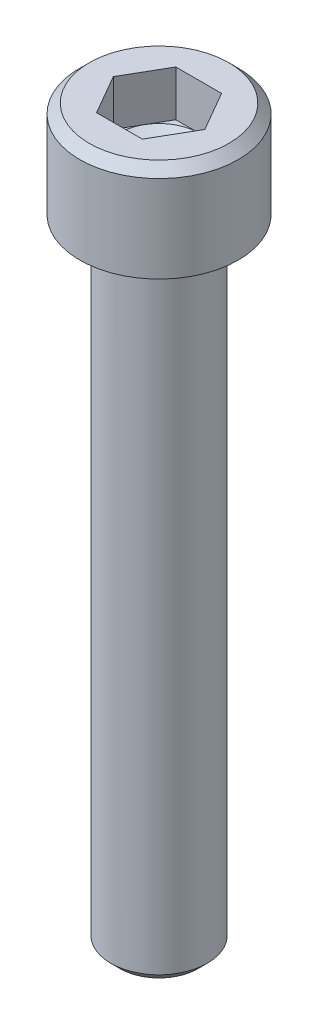
ISO-10303-21;
HEADER;
FILE_DESCRIPTION(('STEP AP214'),'2;1');
FILE_NAME('part.step','',(''),(''),'','','');
FILE_SCHEMA(('AUTOMOTIVE_DESIGN { 1 0 10303 214 1 1 1 1 }'));
ENDSEC;
DATA;
#1=APPLICATION_CONTEXT('core data for automotive mechanical design processes');
#2=APPLICATION_PROTOCOL_DEFINITION('international standard','automotive_design',2000,#1);
#3=PRODUCT_CONTEXT('',#1,'mechanical');
#4=PRODUCT('Part','Part','',(#3));
#5=PRODUCT_RELATED_PRODUCT_CATEGORY('part','',(#4));
#6=PRODUCT_DEFINITION_FORMATION('','',#4);
#7=PRODUCT_DEFINITION_CONTEXT('part definition',#1,'design');
#8=PRODUCT_DEFINITION('design','',#6,#7);
#9=PRODUCT_DEFINITION_SHAPE('','',#8);
#10=(LENGTH_UNIT() NAMED_UNIT(*) SI_UNIT(.MILLI.,.METRE.));
#11=(NAMED_UNIT(*) PLANE_ANGLE_UNIT() SI_UNIT($,.RADIAN.));
#12=(NAMED_UNIT(*) SI_UNIT($,.STERADIAN.) SOLID_ANGLE_UNIT());
#13=UNCERTAINTY_MEASURE_WITH_UNIT(LENGTH_MEASURE(1.E-05),#10,'distance_accuracy_value','');
#14=(GEOMETRIC_REPRESENTATION_CONTEXT(3) GLOBAL_UNCERTAINTY_ASSIGNED_CONTEXT((#13)) GLOBAL_UNIT_ASSIGNED_CONTEXT((#10,
#11,#12)) REPRESENTATION_CONTEXT('',''));
#15=CARTESIAN_POINT('',(0.,0.,0.));
#16=DIRECTION('',(0.,0.,1.));
#17=DIRECTION('',(1.,0.,0.));
#18=AXIS2_PLACEMENT_3D('',#15,#16,#17);
#19=CARTESIAN_POINT('',(0.,2.54,0.));
#20=DIRECTION('',(0.,1.,0.));
#21=DIRECTION('',(-1.,0.,0.));
#22=AXIS2_PLACEMENT_3D('',#19,#20,#21);
#23=PLANE('',#22);
#24=DIRECTION('',(-1.,0.,0.));
#25=VECTOR('',#24,1.);
#26=CARTESIAN_POINT('',(0.,2.54,1.985));
#27=LINE('',#26,#25);
#28=CARTESIAN_POINT('',(-1.14604028434141,2.54,1.985));
#29=VERTEX_POINT('',#28);
#30=CARTESIAN_POINT('',(0.,2.53999999997418,1.98499999995501));
#31=VERTEX_POINT('',#30);
#32=EDGE_CURVE('E96',#29,#31,#27,.F.);
#33=ORIENTED_EDGE('',*,*,#32,.T.);
#34=CARTESIAN_POINT('',(0.,2.53999999999519,0.));
#35=DIRECTION('',(0.,1.,0.));
#36=DIRECTION('',(0.,0.,1.));
#37=AXIS2_PLACEMENT_3D('',#34,#35,#36);
#38=CIRCLE('',#37,1.98499999999058);
#39=CARTESIAN_POINT('',(-1.71906042650803,2.5399999999976,0.992499999997643));
#40=VERTEX_POINT('',#39);
#41=EDGE_CURVE('E109',#31,#40,#38,.F.);
#42=ORIENTED_EDGE('',*,*,#41,.T.);
#43=DIRECTION('',(0.5,0.,0.866025403784439));
#44=VECTOR('',#43,1.);
#45=CARTESIAN_POINT('',(-1.71906042651211,2.54,0.992499999999999));
#46=LINE('',#45,#44);
#47=EDGE_CURVE('E112',#40,#29,#46,.T.);
#48=ORIENTED_EDGE('',*,*,#47,.T.);
#49=EDGE_LOOP('',(#33,#42,#48));
#50=FACE_BOUND('',#49,.T.);
#51=ADVANCED_FACE('F15',(#50),#23,.T.);
#52=CARTESIAN_POINT('',(0.,2.54,0.));
#53=DIRECTION('',(0.,1.,0.));
#54=DIRECTION('',(-1.,0.,0.));
#55=AXIS2_PLACEMENT_3D('',#52,#53,#54);
#56=PLANE('',#55);
#57=DIRECTION('',(0.499999999999998,0.,0.866025403784439));
#58=VECTOR('',#57,1.);
#59=CARTESIAN_POINT('',(-2.29208056868281,2.54,0.));
#60=LINE('',#59,#58);
#61=CARTESIAN_POINT('',(-2.29208056868281,2.54,0.));
#62=VERTEX_POINT('',#61);
#63=EDGE_CURVE('E186',#62,#40,#60,.T.);
#64=ORIENTED_EDGE('',*,*,#63,.T.);
#65=CARTESIAN_POINT('',(0.,2.53999999999519,0.));
#66=DIRECTION('',(0.,1.,0.));
#67=DIRECTION('',(0.,0.,1.));
#68=AXIS2_PLACEMENT_3D('',#65,#66,#67);
#69=CIRCLE('',#68,1.98499999999058);
#70=CARTESIAN_POINT('',(-1.71906042650803,2.5399999999976,-0.992499999997645));
#71=VERTEX_POINT('',#70);
#72=EDGE_CURVE('E128',#40,#71,#69,.F.);
#73=ORIENTED_EDGE('',*,*,#72,.T.);
#74=DIRECTION('',(-0.499999999999999,0.,0.866025403784439));
#75=VECTOR('',#74,1.);
#76=CARTESIAN_POINT('',(-1.71906042651211,2.54,-0.992500000000001));
#77=LINE('',#76,#75);
#78=EDGE_CURVE('E113',#71,#62,#77,.T.);
#79=ORIENTED_EDGE('',*,*,#78,.T.);
#80=EDGE_LOOP('',(#64,#73,#79));
#81=FACE_BOUND('',#80,.T.);
#82=ADVANCED_FACE('F337',(#81),#56,.T.);
#83=CARTESIAN_POINT('',(0.,2.54,0.));
#84=DIRECTION('',(0.,1.,0.));
#85=DIRECTION('',(-1.,0.,0.));
#86=AXIS2_PLACEMENT_3D('',#83,#84,#85);
#87=PLANE('',#86);
#88=DIRECTION('',(-0.5,0.,0.866025403784438));
#89=VECTOR('',#88,1.);
#90=CARTESIAN_POINT('',(-1.14604028434141,2.54,-1.985));
#91=LINE('',#90,#89);
#92=CARTESIAN_POINT('',(-1.14604028434141,2.54,-1.985));
#93=VERTEX_POINT('',#92);
#94=EDGE_CURVE('E195',#93,#71,#91,.T.);
#95=ORIENTED_EDGE('',*,*,#94,.T.);
#96=CARTESIAN_POINT('',(0.,2.53999999999519,0.));
#97=DIRECTION('',(0.,1.,0.));
#98=DIRECTION('',(0.,0.,1.));
#99=AXIS2_PLACEMENT_3D('',#96,#97,#98);
#100=CIRCLE('',#99,1.98499999999058);
#101=CARTESIAN_POINT('',(0.,2.53999999996917,-1.98499999993845));
#102=VERTEX_POINT('',#101);
#103=EDGE_CURVE('E130',#71,#102,#100,.F.);
#104=ORIENTED_EDGE('',*,*,#103,.T.);
#105=DIRECTION('',(-1.,0.,0.));
#106=VECTOR('',#105,1.);
#107=CARTESIAN_POINT('',(0.,2.54,-1.985));
#108=LINE('',#107,#106);
#109=EDGE_CURVE('E190',#102,#93,#108,.T.);
#110=ORIENTED_EDGE('',*,*,#109,.T.);
#111=EDGE_LOOP('',(#95,#104,#110));
#112=FACE_BOUND('',#111,.T.);
#113=ADVANCED_FACE('F334',(#112),#87,.T.);
#114=CARTESIAN_POINT('',(0.,2.54,0.));
#115=DIRECTION('',(0.,1.,0.));
#116=DIRECTION('',(-1.,0.,0.));
#117=AXIS2_PLACEMENT_3D('',#114,#115,#116);
#118=PLANE('',#117);
#119=DIRECTION('',(-1.,0.,0.));
#120=VECTOR('',#119,1.);
#121=CARTESIAN_POINT('',(0.,2.54,-1.985));
#122=LINE('',#121,#120);
#123=CARTESIAN_POINT('',(1.14604028434141,2.54,-1.985));
#124=VERTEX_POINT('',#123);
#125=EDGE_CURVE('E103',#124,#102,#122,.T.);
#126=ORIENTED_EDGE('',*,*,#125,.T.);
#127=CARTESIAN_POINT('',(0.,2.53999999999519,0.));
#128=DIRECTION('',(0.,1.,0.));
#129=DIRECTION('',(0.,0.,1.));
#130=AXIS2_PLACEMENT_3D('',#127,#128,#129);
#131=CIRCLE('',#130,1.98499999999058);
#132=CARTESIAN_POINT('',(1.71906042650803,2.53999999999759,-0.992499999997645));
#133=VERTEX_POINT('',#132);
#134=EDGE_CURVE('E122',#102,#133,#131,.F.);
#135=ORIENTED_EDGE('',*,*,#134,.T.);
#136=DIRECTION('',(-0.5,0.,-0.866025403784438));
#137=VECTOR('',#136,1.);
#138=CARTESIAN_POINT('',(1.71906042651211,2.54,-0.9925));
#139=LINE('',#138,#137);
#140=EDGE_CURVE('E200',#133,#124,#139,.T.);
#141=ORIENTED_EDGE('',*,*,#140,.T.);
#142=EDGE_LOOP('',(#126,#135,#141));
#143=FACE_BOUND('',#142,.T.);
#144=ADVANCED_FACE('F331',(#143),#118,.T.);
#145=CARTESIAN_POINT('',(0.,2.54,0.));
#146=DIRECTION('',(0.,1.,0.));
#147=DIRECTION('',(-1.,0.,0.));
#148=AXIS2_PLACEMENT_3D('',#145,#146,#147);
#149=PLANE('',#148);
#150=DIRECTION('',(0.5,0.,-0.866025403784439));
#151=VECTOR('',#150,1.);
#152=CARTESIAN_POINT('',(1.14604028434141,2.54,1.985));
#153=LINE('',#152,#151);
#154=CARTESIAN_POINT('',(1.14604028434141,2.54,1.985));
#155=VERTEX_POINT('',#154);
#156=CARTESIAN_POINT('',(1.71906042650803,2.5399999999976,0.992499999997644));
#157=VERTEX_POINT('',#156);
#158=EDGE_CURVE('E102',#155,#157,#153,.T.);
#159=ORIENTED_EDGE('',*,*,#158,.T.);
#160=CARTESIAN_POINT('',(0.,2.53999999999519,0.));
#161=DIRECTION('',(0.,1.,0.));
#162=DIRECTION('',(0.,0.,1.));
#163=AXIS2_PLACEMENT_3D('',#160,#161,#162);
#164=CIRCLE('',#163,1.98499999999058);
#165=EDGE_CURVE('E116',#157,#31,#164,.F.);
#166=ORIENTED_EDGE('',*,*,#165,.T.);
#167=DIRECTION('',(-1.,0.,0.));
#168=VECTOR('',#167,1.);
#169=CARTESIAN_POINT('',(0.,2.54,1.985));
#170=LINE('',#169,#168);
#171=EDGE_CURVE('E93',#31,#155,#170,.F.);
#172=ORIENTED_EDGE('',*,*,#171,.T.);
#173=EDGE_LOOP('',(#159,#166,#172));
#174=FACE_BOUND('',#173,.T.);
#175=ADVANCED_FACE('F117',(#174),#149,.T.);
#176=CARTESIAN_POINT('',(0.,2.53999999989674,0.));
#177=DIRECTION('',(0.,1.,0.));
#178=DIRECTION('',(0.,0.,1.));
#179=AXIS2_PLACEMENT_3D('',#176,#177,#178);
#180=CONICAL_SURFACE('',#179,1.98499999982005,1.04719755105136);
#181=CARTESIAN_POINT('',(0.,1.39395971567069,0.));
#182=VERTEX_POINT('',#181);
#183=VERTEX_LOOP('',#182);
#184=FACE_BOUND('',#183,.T.);
#185=ORIENTED_EDGE('',*,*,#41,.F.);
#186=ORIENTED_EDGE('',*,*,#165,.F.);
#187=CARTESIAN_POINT('',(0.,2.53999999999519,0.));
#188=DIRECTION('',(0.,1.,0.));
#189=DIRECTION('',(0.,0.,1.));
#190=AXIS2_PLACEMENT_3D('',#187,#188,#189);
#191=CIRCLE('',#190,1.98499999999058);
#192=EDGE_CURVE('E138',#133,#157,#191,.F.);
#193=ORIENTED_EDGE('',*,*,#192,.F.);
#194=ORIENTED_EDGE('',*,*,#134,.F.);
#195=ORIENTED_EDGE('',*,*,#103,.F.);
#196=ORIENTED_EDGE('',*,*,#72,.F.);
#197=EDGE_LOOP('',(#185,#186,#193,#194,#195,#196));
#198=FACE_BOUND('',#197,.T.);
#199=ADVANCED_FACE('F125',(#184,#198),#180,.F.);
#200=CARTESIAN_POINT('',(0.,2.54,0.));
#201=DIRECTION('',(0.,1.,0.));
#202=DIRECTION('',(-1.,0.,0.));
#203=AXIS2_PLACEMENT_3D('',#200,#201,#202);
#204=PLANE('',#203);
#205=DIRECTION('',(-0.499999999999999,0.,-0.866025403784439));
#206=VECTOR('',#205,1.);
#207=CARTESIAN_POINT('',(2.29208056868281,2.54,0.));
#208=LINE('',#207,#206);
#209=CARTESIAN_POINT('',(2.29208056868281,2.54,0.));
#210=VERTEX_POINT('',#209);
#211=EDGE_CURVE('E121',#210,#133,#208,.T.);
#212=ORIENTED_EDGE('',*,*,#211,.T.);
#213=ORIENTED_EDGE('',*,*,#192,.T.);
#214=DIRECTION('',(0.5,0.,-0.866025403784439));
#215=VECTOR('',#214,1.);
#216=CARTESIAN_POINT('',(1.14604028434141,2.54,1.985));
#217=LINE('',#216,#215);
#218=EDGE_CURVE('E140',#157,#210,#217,.T.);
#219=ORIENTED_EDGE('',*,*,#218,.T.);
#220=EDGE_LOOP('',(#212,#213,#219));
#221=FACE_BOUND('',#220,.T.);
#222=ADVANCED_FACE('F322',(#221),#204,.T.);
#223=CARTESIAN_POINT('',(-1.14604028434141,4.83,1.985));
#224=DIRECTION('',(0.,0.,1.));
#225=DIRECTION('',(1.,0.,0.));
#226=AXIS2_PLACEMENT_3D('',#223,#224,#225);
#227=PLANE('',#226);
#228=DIRECTION('',(1.,0.,0.));
#229=VECTOR('',#228,1.);
#230=CARTESIAN_POINT('',(0.,4.83,1.985));
#231=LINE('',#230,#229);
#232=CARTESIAN_POINT('',(-1.14604028434141,4.83,1.985));
#233=VERTEX_POINT('',#232);
#234=CARTESIAN_POINT('',(1.14604028434141,4.83,1.985));
#235=VERTEX_POINT('',#234);
#236=EDGE_CURVE('E163',#233,#235,#231,.T.);
#237=ORIENTED_EDGE('',*,*,#236,.T.);
#238=DIRECTION('',(0.,1.,0.));
#239=VECTOR('',#238,1.);
#240=CARTESIAN_POINT('',(1.14604028434141,4.83,1.985));
#241=LINE('',#240,#239);
#242=EDGE_CURVE('E99',#235,#155,#241,.F.);
#243=ORIENTED_EDGE('',*,*,#242,.T.);
#244=ORIENTED_EDGE('',*,*,#171,.F.);
#245=ORIENTED_EDGE('',*,*,#32,.F.);
#246=DIRECTION('',(0.,1.,0.));
#247=VECTOR('',#246,1.);
#248=CARTESIAN_POINT('',(-1.14604028434141,4.83,1.985));
#249=LINE('',#248,#247);
#250=EDGE_CURVE('E155',#29,#233,#249,.T.);
#251=ORIENTED_EDGE('',*,*,#250,.T.);
#252=EDGE_LOOP('',(#237,#243,#244,#245,#251));
#253=FACE_BOUND('',#252,.T.);
#254=ADVANCED_FACE('F95',(#253),#227,.F.);
#255=CARTESIAN_POINT('',(1.14604028434141,4.83,1.985));
#256=DIRECTION('',(0.866025403784439,0.,0.5));
#257=DIRECTION('',(0.5,0.,-0.866025403784439));
#258=AXIS2_PLACEMENT_3D('',#255,#256,#257);
#259=PLANE('',#258);
#260=DIRECTION('',(0.5,0.,-0.866025403784439));
#261=VECTOR('',#260,1.);
#262=CARTESIAN_POINT('',(1.14604028434141,4.83,1.985));
#263=LINE('',#262,#261);
#264=CARTESIAN_POINT('',(2.29208056868282,4.83,0.));
#265=VERTEX_POINT('',#264);
#266=EDGE_CURVE('E226',#235,#265,#263,.T.);
#267=ORIENTED_EDGE('',*,*,#266,.T.);
#268=DIRECTION('',(0.,1.,0.));
#269=VECTOR('',#268,1.);
#270=CARTESIAN_POINT('',(2.29208056868282,4.83,0.));
#271=LINE('',#270,#269);
#272=EDGE_CURVE('E173',#265,#210,#271,.F.);
#273=ORIENTED_EDGE('',*,*,#272,.T.);
#274=ORIENTED_EDGE('',*,*,#218,.F.);
#275=ORIENTED_EDGE('',*,*,#158,.F.);
#276=ORIENTED_EDGE('',*,*,#242,.F.);
#277=EDGE_LOOP('',(#267,#273,#274,#275,#276));
#278=FACE_BOUND('',#277,.T.);
#279=ADVANCED_FACE('F315',(#278),#259,.F.);
#280=CARTESIAN_POINT('',(2.29208056868282,4.83,0.));
#281=DIRECTION('',(0.866025403784439,0.,-0.5));
#282=DIRECTION('',(-0.5,0.,-0.866025403784439));
#283=AXIS2_PLACEMENT_3D('',#280,#281,#282);
#284=PLANE('',#283);
#285=DIRECTION('',(-0.5,0.,-0.866025403784439));
#286=VECTOR('',#285,1.);
#287=CARTESIAN_POINT('',(2.29208056868282,4.83,0.));
#288=LINE('',#287,#286);
#289=CARTESIAN_POINT('',(1.14604028434141,4.83,-1.985));
#290=VERTEX_POINT('',#289);
#291=EDGE_CURVE('E228',#265,#290,#288,.T.);
#292=ORIENTED_EDGE('',*,*,#291,.T.);
#293=DIRECTION('',(0.,1.,0.));
#294=VECTOR('',#293,1.);
#295=CARTESIAN_POINT('',(1.14604028434141,4.83,-1.985));
#296=LINE('',#295,#294);
#297=EDGE_CURVE('E168',#290,#124,#296,.F.);
#298=ORIENTED_EDGE('',*,*,#297,.T.);
#299=ORIENTED_EDGE('',*,*,#140,.F.);
#300=ORIENTED_EDGE('',*,*,#211,.F.);
#301=ORIENTED_EDGE('',*,*,#272,.F.);
#302=EDGE_LOOP('',(#292,#298,#299,#300,#301));
#303=FACE_BOUND('',#302,.T.);
#304=ADVANCED_FACE('F311',(#303),#284,.F.);
#305=CARTESIAN_POINT('',(1.14604028434141,4.83,-1.985));
#306=DIRECTION('',(0.,0.,-1.));
#307=DIRECTION('',(-1.,0.,0.));
#308=AXIS2_PLACEMENT_3D('',#305,#306,#307);
#309=PLANE('',#308);
#310=DIRECTION('',(1.,0.,0.));
#311=VECTOR('',#310,1.);
#312=CARTESIAN_POINT('',(0.,4.83,-1.985));
#313=LINE('',#312,#311);
#314=CARTESIAN_POINT('',(-1.14604028434141,4.83,-1.985));
#315=VERTEX_POINT('',#314);
#316=EDGE_CURVE('E230',#290,#315,#313,.F.);
#317=ORIENTED_EDGE('',*,*,#316,.T.);
#318=DIRECTION('',(0.,1.,0.));
#319=VECTOR('',#318,1.);
#320=CARTESIAN_POINT('',(-1.14604028434141,4.83,-1.985));
#321=LINE('',#320,#319);
#322=EDGE_CURVE('E158',#315,#93,#321,.F.);
#323=ORIENTED_EDGE('',*,*,#322,.T.);
#324=ORIENTED_EDGE('',*,*,#109,.F.);
#325=ORIENTED_EDGE('',*,*,#125,.F.);
#326=ORIENTED_EDGE('',*,*,#297,.F.);
#327=EDGE_LOOP('',(#317,#323,#324,#325,#326));
#328=FACE_BOUND('',#327,.T.);
#329=ADVANCED_FACE('F307',(#328),#309,.F.);
#330=CARTESIAN_POINT('',(-1.14604028434141,4.83,-1.985));
#331=DIRECTION('',(-0.866025403784439,0.,-0.5));
#332=DIRECTION('',(-0.5,0.,0.866025403784439));
#333=AXIS2_PLACEMENT_3D('',#330,#331,#332);
#334=PLANE('',#333);
#335=DIRECTION('',(-0.5,0.,0.866025403784439));
#336=VECTOR('',#335,1.);
#337=CARTESIAN_POINT('',(-1.14604028434141,4.83,-1.985));
#338=LINE('',#337,#336);
#339=CARTESIAN_POINT('',(-2.29208056868281,4.83,0.));
#340=VERTEX_POINT('',#339);
#341=EDGE_CURVE('E232',#315,#340,#338,.T.);
#342=ORIENTED_EDGE('',*,*,#341,.T.);
#343=DIRECTION('',(0.,1.,0.));
#344=VECTOR('',#343,1.);
#345=CARTESIAN_POINT('',(-2.29208056868281,4.83,0.));
#346=LINE('',#345,#344);
#347=EDGE_CURVE('E157',#340,#62,#346,.F.);
#348=ORIENTED_EDGE('',*,*,#347,.T.);
#349=ORIENTED_EDGE('',*,*,#78,.F.);
#350=ORIENTED_EDGE('',*,*,#94,.F.);
#351=ORIENTED_EDGE('',*,*,#322,.F.);
#352=EDGE_LOOP('',(#342,#348,#349,#350,#351));
#353=FACE_BOUND('',#352,.T.);
#354=ADVANCED_FACE('F303',(#353),#334,.F.);
#355=CARTESIAN_POINT('',(-2.29208056868281,4.83,0.));
#356=DIRECTION('',(-0.866025403784439,0.,0.5));
#357=DIRECTION('',(0.5,0.,0.866025403784439));
#358=AXIS2_PLACEMENT_3D('',#355,#356,#357);
#359=PLANE('',#358);
#360=DIRECTION('',(0.5,0.,0.866025403784439));
#361=VECTOR('',#360,1.);
#362=CARTESIAN_POINT('',(-2.29208056868281,4.83,0.));
#363=LINE('',#362,#361);
#364=EDGE_CURVE('E145',#340,#233,#363,.T.);
#365=ORIENTED_EDGE('',*,*,#364,.T.);
#366=ORIENTED_EDGE('',*,*,#250,.F.);
#367=ORIENTED_EDGE('',*,*,#47,.F.);
#368=ORIENTED_EDGE('',*,*,#63,.F.);
#369=ORIENTED_EDGE('',*,*,#347,.F.);
#370=EDGE_LOOP('',(#365,#366,#367,#368,#369));
#371=FACE_BOUND('',#370,.T.);
#372=ADVANCED_FACE('F299',(#371),#359,.F.);
#373=CARTESIAN_POINT('',(0.,4.83,0.));
#374=DIRECTION('',(0.,-1.,0.));
#375=DIRECTION('',(1.,0.,0.));
#376=AXIS2_PLACEMENT_3D('',#373,#374,#375);
#377=PLANE('',#376);
#378=ORIENTED_EDGE('',*,*,#341,.F.);
#379=ORIENTED_EDGE('',*,*,#316,.F.);
#380=ORIENTED_EDGE('',*,*,#291,.F.);
#381=ORIENTED_EDGE('',*,*,#266,.F.);
#382=ORIENTED_EDGE('',*,*,#236,.F.);
#383=ORIENTED_EDGE('',*,*,#364,.F.);
#384=EDGE_LOOP('',(#378,#379,#380,#381,#382,#383));
#385=FACE_BOUND('',#384,.T.);
#386=CARTESIAN_POINT('',(0.,4.83000000025413,0.));
#387=DIRECTION('',(0.,-1.,0.));
#388=DIRECTION('',(1.,0.,0.));
#389=AXIS2_PLACEMENT_3D('',#386,#387,#388);
#390=CIRCLE('',#389,3.49999999968986);
#391=CARTESIAN_POINT('',(3.49999999968987,4.83000000025413,0.));
#392=VERTEX_POINT('',#391);
#393=EDGE_CURVE('E141',#392,#392,#390,.T.);
#394=ORIENTED_EDGE('',*,*,#393,.F.);
#395=EDGE_LOOP('',(#394));
#396=FACE_BOUND('',#395,.T.);
#397=ADVANCED_FACE('F295',(#385,#396),#377,.F.);
#398=CARTESIAN_POINT('',(0.,4.3600000007018,0.));
#399=DIRECTION('',(0.,-1.,0.));
#400=DIRECTION('',(1.,0.,0.));
#401=AXIS2_PLACEMENT_3D('',#398,#399,#400);
#402=CONICAL_SURFACE('',#401,3.96999999929903,0.78539816345792);
#403=CARTESIAN_POINT('',(0.,4.36,0.));
#404=DIRECTION('',(0.,-1.,0.));
#405=DIRECTION('',(1.,0.,0.));
#406=AXIS2_PLACEMENT_3D('',#403,#404,#405);
#407=CIRCLE('',#406,3.97);
#408=CARTESIAN_POINT('',(3.97,4.36,0.));
#409=VERTEX_POINT('',#408);
#410=EDGE_CURVE('E144',#409,#409,#407,.T.);
#411=ORIENTED_EDGE('',*,*,#410,.F.);
#412=EDGE_LOOP('',(#411));
#413=FACE_BOUND('',#412,.T.);
#414=ORIENTED_EDGE('',*,*,#393,.T.);
#415=EDGE_LOOP('',(#414));
#416=FACE_BOUND('',#415,.T.);
#417=ADVANCED_FACE('F291',(#413,#416),#402,.T.);
#418=CARTESIAN_POINT('',(0.,6.659,0.));
#419=DIRECTION('',(0.,-1.,0.));
#420=DIRECTION('',(1.,0.,0.));
#421=AXIS2_PLACEMENT_3D('',#418,#419,#420);
#422=CYLINDRICAL_SURFACE('',#421,3.97);
#423=CARTESIAN_POINT('',(0.,0.,0.));
#424=DIRECTION('',(0.,-1.,0.));
#425=DIRECTION('',(1.,0.,0.));
#426=AXIS2_PLACEMENT_3D('',#423,#424,#425);
#427=CIRCLE('',#426,3.97);
#428=CARTESIAN_POINT('',(3.97,0.,0.));
#429=VERTEX_POINT('',#428);
#430=EDGE_CURVE('E146',#429,#429,#427,.T.);
#431=ORIENTED_EDGE('',*,*,#430,.F.);
#432=EDGE_LOOP('',(#431));
#433=FACE_BOUND('',#432,.T.);
#434=ORIENTED_EDGE('',*,*,#410,.T.);
#435=EDGE_LOOP('',(#434));
#436=FACE_BOUND('',#435,.T.);
#437=ADVANCED_FACE('F287',(#433,#436),#422,.T.);
#438=CARTESIAN_POINT('',(0.,-31.75,0.));
#439=DIRECTION('',(0.,-1.,0.));
#440=DIRECTION('',(1.,0.,0.));
#441=AXIS2_PLACEMENT_3D('',#438,#439,#440);
#442=PLANE('',#441);
#443=CARTESIAN_POINT('',(0.,-31.7500000004429,0.));
#444=DIRECTION('',(0.,1.,0.));
#445=DIRECTION('',(0.,0.,1.));
#446=AXIS2_PLACEMENT_3D('',#443,#444,#445);
#447=CIRCLE('',#446,1.94499999952313);
#448=CARTESIAN_POINT('',(0.,-31.7500000004429,1.94499999952313));
#449=VERTEX_POINT('',#448);
#450=EDGE_CURVE('E149',#449,#449,#447,.T.);
#451=ORIENTED_EDGE('',*,*,#450,.F.);
#452=EDGE_LOOP('',(#451));
#453=FACE_BOUND('',#452,.T.);
#454=ADVANCED_FACE('F276',(#453),#442,.T.);
#455=CARTESIAN_POINT('',(0.,0.,0.));
#456=DIRECTION('',(0.,-1.,0.));
#457=DIRECTION('',(1.,0.,0.));
#458=AXIS2_PLACEMENT_3D('',#455,#456,#457);
#459=PLANE('',#458);
#460=CARTESIAN_POINT('',(0.,0.,0.));
#461=DIRECTION('',(0.,-1.,0.));
#462=DIRECTION('',(1.,0.,-1.33869079486962E-11));
#463=AXIS2_PLACEMENT_3D('',#460,#461,#462);
#464=CIRCLE('',#463,2.77499999996582);
#465=CARTESIAN_POINT('',(-2.7749999999795,0.,-2.89208909147852E-10));
#466=VERTEX_POINT('',#465);
#467=CARTESIAN_POINT('',(2.77499999997949,0.,6.00706193947601E-10));
#468=VERTEX_POINT('',#467);
#469=EDGE_CURVE('E152',#466,#468,#464,.F.);
#470=ORIENTED_EDGE('',*,*,#469,.T.);
#471=CARTESIAN_POINT('',(-2.77500000000001,0.,0.));
#472=CARTESIAN_POINT('',(-2.77499841186302,-6.32327529551953E-12,-0.00366471468664834));
#473=CARTESIAN_POINT('',(-2.77498998320405,-1.24229866352711E-11,-0.00732943287161626));
#474=CARTESIAN_POINT('',(-2.77493454454913,-3.3543997208659E-11,-0.020530223690674));
#475=CARTESIAN_POINT('',(-2.77484735680571,-4.72017141696549E-11,-0.0300661509767437));
#476=CARTESIAN_POINT('',(-2.77449041068414,-7.81781161675773E-11,-0.0550074317178602));
#477=CARTESIAN_POINT('',(-2.77414129586314,-9.25735084655453E-11,-0.0704116966209371));
#478=CARTESIAN_POINT('',(-2.77300532410106,-1.21004272987395E-10,-0.107080885691172));
#479=CARTESIAN_POINT('',(-2.7721023550085,-1.32812150949339E-10,-0.128342271262109));
#480=CARTESIAN_POINT('',(-2.76949109234732,-1.52499734069692E-10,-0.176701511279828));
#481=CARTESIAN_POINT('',(-2.76762934195148,-1.58396744622451E-10,-0.203791164770525));
#482=CARTESIAN_POINT('',(-2.76262340571396,-1.64574080469271E-10,-0.263755180733665));
#483=CARTESIAN_POINT('',(-2.75928896352518,-1.63364154433086E-10,-0.29661375507272));
#484=CARTESIAN_POINT('',(-2.75075255371383,-1.54945967736279E-10,-0.368020950564298));
#485=CARTESIAN_POINT('',(-2.74532396457494,-1.46709561135951E-10,-0.406542626260531));
#486=CARTESIAN_POINT('',(-2.73191127042508,-1.25294282752216E-10,-0.489118573517418));
#487=CARTESIAN_POINT('',(-2.7236651187834,-1.11557055138451E-10,-0.533130326979868));
#488=CARTESIAN_POINT('',(-2.70383193334389,-8.22840826597709E-11,-0.626449183956045));
#489=CARTESIAN_POINT('',(-2.69194860051965,-6.67487145281502E-11,-0.675693868718792));
#490=CARTESIAN_POINT('',(-2.67154322230688,-4.41412321871352E-11,-0.751137880582462));
#491=CARTESIAN_POINT('',(-2.66396291375819,-3.6442917249874E-11,-0.777595875642849));
#492=CARTESIAN_POINT('',(-2.64759312755477,-2.50054632404198E-11,-0.83168041084313));
#493=CARTESIAN_POINT('',(-2.63876072219639,-2.14993830276523E-11,-0.85929401322766));
#494=CARTESIAN_POINT('',(-2.61976638317633,-5.14187225196482E-12,-0.915621740739464));
#495=CARTESIAN_POINT('',(-2.60955977496835,8.17375668488553E-12,-0.944320794908436));
#496=CARTESIAN_POINT('',(-2.58769145627301,-1.36878992863661E-11,-1.00274163777327));
#497=CARTESIAN_POINT('',(-2.5759833256814,-5.12331162623412E-11,-1.03244606015575));
#498=CARTESIAN_POINT('',(-2.55113098913795,5.19188738793594E-11,-1.09245739421103));
#499=CARTESIAN_POINT('',(-2.53795108128106,1.98836951440955E-10,-1.12274952081302));
#500=CARTESIAN_POINT('',(-2.5105305326628,-1.35727689574166E-09,-1.18284948017198));
#501=CARTESIAN_POINT('',(-2.49628990006389,-3.06029458627576E-09,-1.2126573166535));
#502=CARTESIAN_POINT('',(-2.46676318394427,-1.2843438797839E-08,-1.27175084095231));
#503=CARTESIAN_POINT('',(-2.45147709498237,-2.0923598511653E-08,-1.30103652605101));
#504=CARTESIAN_POINT('',(-2.41988089390513,-5.59482122921833E-08,-1.35905078952955));
#505=CARTESIAN_POINT('',(-2.4035707632564,-8.28930078660993E-08,-1.3877793578142));
#506=CARTESIAN_POINT('',(-2.36993893405465,-1.54742426365412E-07,-1.44463987803149));
#507=CARTESIAN_POINT('',(-2.35261720415807,-1.99647606030853E-07,-1.47277181144105));
#508=CARTESIAN_POINT('',(-2.32591312493591,-3.29706168113037E-07,-1.51450720924309));
#509=CARTESIAN_POINT('',(-2.31689118776782,-3.83512149710714E-07,-1.52834240330003));
#510=CARTESIAN_POINT('',(-2.3033330337083,-4.3354444184941E-07,-1.54869218351762));
#511=CARTESIAN_POINT('',(-2.29890113661903,-4.45162154132968E-07,-1.55527625573644));
#512=CARTESIAN_POINT('',(-2.27914453999552,-4.72976187619715E-07,-1.58433085389446));
#513=CARTESIAN_POINT('',(-2.26348807366437,-4.31853948847192E-07,-1.60657585590711));
#514=CARTESIAN_POINT('',(-2.21504875179904,-3.03226517338797E-07,-1.67327464508904));
#515=CARTESIAN_POINT('',(-2.18124265120751,-2.11591179738137E-07,-1.71699284432922));
#516=CARTESIAN_POINT('',(-2.1242675653814,-9.91258201640217E-08,-1.78628340283305));
#517=CARTESIAN_POINT('',(-2.10187544243623,-6.46284195091659E-08,-1.81250083605209));
#518=CARTESIAN_POINT('',(-2.05593255008564,-1.87491089674944E-08,-1.86431559623458));
#519=CARTESIAN_POINT('',(-2.03237333960544,-7.57263681955711E-09,-1.88990546560311));
#520=CARTESIAN_POINT('',(-1.99315886014221,-2.564288371497E-10,-1.93095037580794));
#521=CARTESIAN_POINT('',(-1.97778186295879,-9.93104905668772E-11,-1.94667283294372));
#522=CARTESIAN_POINT('',(-1.93885495624145,1.49181179354494E-10,-1.98556982926974));
#523=CARTESIAN_POINT('',(-1.91507994783709,1.67874934928301E-10,-2.0085201657837));
#524=CARTESIAN_POINT('',(-1.86673073199172,-2.24003171290347E-10,-2.05356153886774));
#525=CARTESIAN_POINT('',(-1.8421565361649,-6.34568797574612E-10,-2.07565258791517));
#526=CARTESIAN_POINT('',(-1.79224447501965,-6.1817379709615E-09,-2.11895454640906));
#527=CARTESIAN_POINT('',(-1.76690660948787,-1.13183428384121E-08,-2.14016545560962));
#528=CARTESIAN_POINT('',(-1.71549841946449,-3.94568749276157E-08,-2.18168099357328));
#529=CARTESIAN_POINT('',(-1.6894280839303,-6.24590716271556E-08,-2.20198560866129));
#530=CARTESIAN_POINT('',(-1.63658189072099,-1.27471057072808E-07,-2.24165736845423));
#531=CARTESIAN_POINT('',(-1.60980601198327,-1.69481413876869E-07,-2.26102448512292));
#532=CARTESIAN_POINT('',(-1.56915322177319,-2.97595903855162E-07,-2.28937273520039));
#533=CARTESIAN_POINT('',(-1.55552030640215,-3.51153599866281E-07,-2.2987053981652));
#534=CARTESIAN_POINT('',(-1.53521147508397,-4.02499770270776E-07,-2.31231555393255));
#535=CARTESIAN_POINT('',(-1.52860549007799,-4.14806249139559E-07,-2.31669739075282));
#536=CARTESIAN_POINT('',(-1.49925058688409,-4.45989676469534E-07,-2.33597039252026));
#537=CARTESIAN_POINT('',(-1.47628082375515,-4.08168335314912E-07,-2.350525726238));
#538=CARTESIAN_POINT('',(-1.41703553421283,-3.09664473524372E-07,-2.38685090458837));
#539=CARTESIAN_POINT('',(-1.38045985381358,-2.47958478427806E-07,-2.4081345880614));
#540=CARTESIAN_POINT('',(-1.3320883973831,-1.71867512008728E-07,-2.43480747078385));
#541=CARTESIAN_POINT('',(-1.32071573331943,-1.54367775137246E-07,-2.44097424758018));
#542=CARTESIAN_POINT('',(-1.27847375242006,-9.51357412374809E-08,-2.46349935321287));
#543=CARTESIAN_POINT('',(-1.24733492081612,-6.27966723614723E-08,-2.47935695367342));
#544=CARTESIAN_POINT('',(-1.18456913306851,-1.90776317841114E-08,-2.50984680599886));
#545=CARTESIAN_POINT('',(-1.15294374591541,-7.64054589190731E-09,-2.52448229237972));
#546=CARTESIAN_POINT('',(-1.10145203460479,-2.96964103435163E-10,-2.54716173668646));
#547=CARTESIAN_POINT('',(-1.08174685920322,-1.0607141725809E-10,-2.5555738224852));
#548=CARTESIAN_POINT('',(-1.0314189554842,1.63578436101822E-10,-2.57639570700956));
#549=CARTESIAN_POINT('',(-1.00066914400403,1.25433118243355E-10,-2.58850033350956));
#550=CARTESIAN_POINT('',(-0.938760134032095,-1.32002423940041E-10,-2.61161007110746));
#551=CARTESIAN_POINT('',(-0.907600941994064,-3.5128979598706E-10,-2.62261519951508));
#552=CARTESIAN_POINT('',(-0.844913945446311,-5.18092289759922E-09,-2.64352022444711));
#553=CARTESIAN_POINT('',(-0.813386141156505,-9.79126600756934E-09,-2.65342012163085));
#554=CARTESIAN_POINT('',(-0.750000735300218,-3.6628382112951E-08,-2.67210251603689));
#555=CARTESIAN_POINT('',(-0.718143128941269,-5.88554114582009E-08,-2.6808849969969));
#556=CARTESIAN_POINT('',(-0.654134908758568,-1.2243600452306E-07,-2.69731402146511));
#557=CARTESIAN_POINT('',(-0.621984286260993,-1.63790136255092E-07,-2.70496053122976));
#558=CARTESIAN_POINT('',(-0.573575450394687,-2.91268252332553E-07,-2.71559444256353));
#559=CARTESIAN_POINT('',(-0.557408113599715,-3.44671820802185E-07,-2.71899987634732));
#560=CARTESIAN_POINT('',(-0.533441015850688,-3.96109648394904E-07,-2.72380144595774));
#561=CARTESIAN_POINT('',(-0.525665949507923,-4.08495525997611E-07,-2.72532082785579));
#562=CARTESIAN_POINT('',(-0.491178875258956,-4.40183459434293E-07,-2.73189176689295));
#563=CARTESIAN_POINT('',(-0.464391344998552,-4.03068964684613E-07,-2.73654852890548));
#564=CARTESIAN_POINT('',(-0.395754439569944,-3.06234580891449E-07,-2.74743716103142));
#565=CARTESIAN_POINT('',(-0.353813748767611,-2.45422155882217E-07,-2.75310470951537));
#566=CARTESIAN_POINT('',(-0.298910454501367,-1.70281490027229E-07,-2.7592372982286));
#567=CARTESIAN_POINT('',(-0.286041210750589,-1.52987874779984E-07,-2.76058281875057));
#568=CARTESIAN_POINT('',(-0.238319081645254,-9.43487841620044E-08,-2.76523546542467));
#569=CARTESIAN_POINT('',(-0.203408529391693,-6.22889505921452E-08,-2.76797408087523));
#570=CARTESIAN_POINT('',(-0.133668517812222,-1.89564881345822E-08,-2.77212302164503));
#571=CARTESIAN_POINT('',(-0.0988394107496817,-7.59007120669211E-09,-2.77353932571964));
#572=CARTESIAN_POINT('',(-0.0426683409825478,-3.0754634256878E-10,-2.7747801562461));
#573=CARTESIAN_POINT('',(-0.02133439069514,-1.08985843578908E-10,-2.77500899297433));
#574=CARTESIAN_POINT('',(0.0330405407642098,1.6878606998802E-10,-2.77498607260601));
#575=CARTESIAN_POINT('',(0.0660821543275428,1.22730648134109E-10,-2.77440171948108));
#576=CARTESIAN_POINT('',(0.132122827611255,-1.27432182525028E-10,-2.77206054681141));
#577=CARTESIAN_POINT('',(0.165121887998695,-3.31537082831576E-10,-2.77030374587538));
#578=CARTESIAN_POINT('',(0.231037605241004,-5.11025235864761E-09,-2.76562799683622));
#579=CARTESIAN_POINT('',(0.263954262152198,-9.68485974603653E-09,-2.76270904952767));
#580=CARTESIAN_POINT('',(0.329664655363122,-3.6454030093247E-08,-2.75571262503239));
#581=CARTESIAN_POINT('',(0.362458389873205,-5.86488485951077E-08,-2.75163513104407));
#582=CARTESIAN_POINT('',(0.427881863011624,-1.22198897901148E-07,-2.74231854867927));
#583=CARTESIAN_POINT('',(0.460511596742306,-1.63554697524771E-07,-2.73707942582068));
#584=CARTESIAN_POINT('',(0.509305301255994,-2.91156727906606E-07,-2.72837856976231));
#585=CARTESIAN_POINT('',(0.525545291352248,-3.44621841498555E-07,-2.72533780009994));
#586=CARTESIAN_POINT('',(0.549527700222363,-3.96138793485044E-07,-2.72060160097366));
#587=CARTESIAN_POINT('',(0.55729445662045,-4.08548490514602E-07,-2.7190294912075));
#588=CARTESIAN_POINT('',(0.591674281980837,-4.40444175344173E-07,-2.71190192312579));
#589=CARTESIAN_POINT('',(0.618205878763347,-4.03802211625529E-07,-2.70595319255893));
#590=CARTESIAN_POINT('',(0.698362400395694,-2.87521913628063E-07,-2.68672836937417));
#591=CARTESIAN_POINT('',(0.75169908069778,-2.02526191473378E-07,-2.67222450771375));
#592=CARTESIAN_POINT('',(0.838062320996454,-9.61401455964283E-08,-2.64593801779582));
#593=CARTESIAN_POINT('',(0.871381463633742,-6.28562219153681E-08,-2.63510067559406));
#594=CARTESIAN_POINT('',(0.937421865027892,-1.86088268918547E-08,-2.61223507458311));
#595=CARTESIAN_POINT('',(0.970145298696822,-7.53303745205359E-09,-2.60021313282435));
#596=CARTESIAN_POINT('',(1.02249379292945,-3.68779371991612E-10,-2.5798704854239));
#597=CARTESIAN_POINT('',(1.04226680696957,-1.28528718363312E-10,-2.57192714561716));
#598=CARTESIAN_POINT('',(1.09247101865959,1.99306187110954E-10,-2.55110679921888));
#599=CARTESIAN_POINT('',(1.122775350451,1.29965277716837E-10,-2.53792171914137));
#600=CARTESIAN_POINT('',(1.18289595450014,-1.34064747224721E-10,-2.51048464392847));
#601=CARTESIAN_POINT('',(1.2127122346856,-3.28751824616972E-10,-2.4962326661444));
#602=CARTESIAN_POINT('',(1.27182394568418,-5.16728413173672E-09,-2.46668658142432));
#603=CARTESIAN_POINT('',(1.30111937697971,-9.81112524050909E-09,-2.45139247545359));
#604=CARTESIAN_POINT('',(1.35915332977904,-3.69904253542681E-08,-2.41978097630029));
#605=CARTESIAN_POINT('',(1.38789184325364,-5.95261421137127E-08,-2.40346356837893));
#606=CARTESIAN_POINT('',(1.44477285474104,-1.24196742060474E-07,-2.3698183542532));
#607=CARTESIAN_POINT('',(1.47291533500433,-1.66332208060807E-07,-2.35249051801639));
#608=CARTESIAN_POINT('',(1.51466736799147,-2.95988892422892E-07,-2.32577844166883));
#609=CARTESIAN_POINT('',(1.52850824624945,-3.50286466863935E-07,-2.31675403031364));
#610=CARTESIAN_POINT('',(1.54887998021236,-4.0300282662099E-07,-2.30318272713107));
#611=CARTESIAN_POINT('',(1.55548034035818,-4.15797298373596E-07,-2.29874019695485));
#612=CARTESIAN_POINT('',(1.58455849691152,-4.48787252024683E-07,-2.27896808677863));
#613=CARTESIAN_POINT('',(1.60681019185226,-4.11980098954437E-07,-2.26330587472448));
#614=CARTESIAN_POINT('',(1.67347741128034,-2.94772873106258E-07,-2.2148855246004));
#615=CARTESIAN_POINT('',(1.71715883712501,-2.08460951406499E-07,-2.18110645056123));
#616=CARTESIAN_POINT('',(1.78700784400831,-9.96157768526457E-08,-2.12367145269319));
#617=CARTESIAN_POINT('',(1.81380029820884,-6.53061692011331E-08,-2.10076829699907));
#618=CARTESIAN_POINT('',(1.86623374708,-1.96019844750323E-08,-2.05419632299218));
#619=CARTESIAN_POINT('',(1.89188361731962,-7.98023179401343E-09,-2.03053753189662));
#620=CARTESIAN_POINT('',(1.93229463042947,-4.58548278575154E-10,-1.99184811110038));
#621=CARTESIAN_POINT('',(1.94734191670814,-1.52848803221733E-10,-1.97711454110417));
#622=CARTESIAN_POINT('',(1.9855859712576,2.39872897884889E-10,-1.93883524789621));
#623=CARTESIAN_POINT('',(2.00854366874619,1.03216476800962E-10,-1.91504946666229));
#624=CARTESIAN_POINT('',(2.05359994545007,-1.04913609202732E-10,-1.86667922491748));
#625=CARTESIAN_POINT('',(2.07569854103587,-1.76388516764215E-10,-1.84209477964185));
#626=CARTESIAN_POINT('',(2.11901583698832,-4.9672582443149E-09,-1.7921625852299));
#627=CARTESIAN_POINT('',(2.14023453978789,-9.68664021190336E-09,-1.76681483820446));
#628=CARTESIAN_POINT('',(2.18176599188534,-3.83598793010117E-08,-1.71538721691223));
#629=CARTESIAN_POINT('',(2.20207872891869,-6.23139967299688E-08,-1.6893073327419));
#630=CARTESIAN_POINT('',(2.24176709205564,-1.32276667564023E-07,-1.63644226334471));
#631=CARTESIAN_POINT('',(2.26114269018685,-1.78285878838292E-07,-1.60965705710172));
#632=CARTESIAN_POINT('',(2.28950405271806,-3.18795062579686E-07,-1.56899049093095));
#633=CARTESIAN_POINT('',(2.29884115543944,-3.7755072755175E-07,-1.55535301353375));
#634=CARTESIAN_POINT('',(2.31256102699845,-4.36887385508059E-07,-1.53488345958168));
#635=CARTESIAN_POINT('',(2.31704667128184,-4.51856876764753E-07,-1.52812035692626));
#636=CARTESIAN_POINT('',(2.3364845984653,-4.91177847058721E-07,-1.49850346667819));
#637=CARTESIAN_POINT('',(2.35109820047473,-4.53972491906901E-07,-1.47542729462025));
#638=CARTESIAN_POINT('',(2.39404844442315,-3.3304318088137E-07,-1.40531308078892));
#639=CARTESIAN_POINT('',(2.42133145564603,-2.40300525283376E-07,-1.35762296916793));
#640=CARTESIAN_POINT('',(2.46439307255811,-1.18409242295998E-07,-1.27686240626748));
#641=CARTESIAN_POINT('',(2.48097561236846,-7.83674984276372E-08,-1.24421615103695));
#642=CARTESIAN_POINT('',(2.51218545295074,-2.4831168498707E-08,-1.17964936127358));
#643=CARTESIAN_POINT('',(2.52686513294055,-1.03119421585631E-08,-1.14775424636126));
#644=CARTESIAN_POINT('',(2.54873405695388,-9.68661353725122E-10,-1.09779040417671));
#645=CARTESIAN_POINT('',(2.55634249177712,-2.46839257692715E-10,-1.07990352397742));
#646=CARTESIAN_POINT('',(2.57636600308504,4.17256511998254E-10,-1.03147040431161));
#647=CARTESIAN_POINT('',(2.58843910218603,-5.3323812041358E-10,-1.00078164991031));
#648=CARTESIAN_POINT('',(2.61148630864905,-1.11782707963085E-09,-0.938995267224243));
#649=CARTESIAN_POINT('',(2.62246042857909,-7.51936462502031E-10,-0.907897643619941));
#650=CARTESIAN_POINT('',(2.64330604551824,-5.99153784461976E-11,-0.84533477528339));
#651=CARTESIAN_POINT('',(2.65317754219183,2.66215076382364E-10,-0.813869530439284));
#652=CARTESIAN_POINT('',(2.67180168225637,-1.66950392940593E-09,-0.75060969130293));
#653=CARTESIAN_POINT('',(2.6805543121684,-3.93138456436421E-09,-0.71881509304797));
#654=CARTESIAN_POINT('',(2.69811963794931,-2.20068922997346E-08,-0.650320565185363));
#655=CARTESIAN_POINT('',(2.70675822616166,-3.97316752682723E-08,-0.613575746545799));
#656=CARTESIAN_POINT('',(2.72054040652685,-8.37738057101873E-08,-0.549051428391293));
#657=CARTESIAN_POINT('',(2.72601648578051,-1.06807051569116E-07,-0.52134239806305));
#658=CARTESIAN_POINT('',(2.73695114283714,-1.40996954444226E-07,-0.461072548815398));
#659=CARTESIAN_POINT('',(2.74225057289855,-1.49490849978993E-07,-0.428482662528022));
#660=CARTESIAN_POINT('',(2.75166117954412,-1.44426066251261E-07,-0.363133025553468));
#661=CARTESIAN_POINT('',(2.7557723895171,-1.30868006716654E-07,-0.330373279665658));
#662=CARTESIAN_POINT('',(2.76279771198275,-9.00659460958123E-08,-0.264727748688145));
#663=CARTESIAN_POINT('',(2.76571188831282,-6.28226750093095E-08,-0.231841970414135));
#664=CARTESIAN_POINT('',(2.77034676096547,-1.49085400411815E-08,-0.165987640610058));
#665=CARTESIAN_POINT('',(2.77206755104401,5.76284007849042E-09,-0.13301909578666));
#666=CARTESIAN_POINT('',(2.77349827133473,-2.30757441106433E-09,-0.0904991200506165));
#667=CARTESIAN_POINT('',(2.77376802646059,-6.3663758478765E-09,-0.0809644629329651));
#668=CARTESIAN_POINT('',(2.77455973094612,-2.00810995359232E-08,-0.0476234509341249));
#669=CARTESIAN_POINT('',(2.77485500743851,-2.90238302980723E-08,-0.0238114958344903));
#670=CARTESIAN_POINT('',(2.77500000000001,0.,0.));
#671=B_SPLINE_CURVE_WITH_KNOTS('',3,(#471,#472,#473,#474,#475,#476,#477,#478,#479,#480,#481,
#482,#483,#484,#485,#486,#487,#488,#489,#490,#491,#492,#493,#494,#495,#496,#497,#498,#499,#500,
#501,#502,#503,#504,#505,#506,#507,#508,#509,#510,#511,#512,#513,#514,#515,#516,#517,#518,#519,
#520,#521,#522,#523,#524,#525,#526,#527,#528,#529,#530,#531,#532,#533,#534,#535,#536,#537,#538,
#539,#540,#541,#542,#543,#544,#545,#546,#547,#548,#549,#550,#551,#552,#553,#554,#555,#556,#557,
#558,#559,#560,#561,#562,#563,#564,#565,#566,#567,#568,#569,#570,#571,#572,#573,#574,#575,#576,
#577,#578,#579,#580,#581,#582,#583,#584,#585,#586,#587,#588,#589,#590,#591,#592,#593,#594,#595,
#596,#597,#598,#599,#600,#601,#602,#603,#604,#605,#606,#607,#608,#609,#610,#611,#612,#613,#614,
#615,#616,#617,#618,#619,#620,#621,#622,#623,#624,#625,#626,#627,#628,#629,#630,#631,#632,#633,
#634,#635,#636,#637,#638,#639,#640,#641,#642,#643,#644,#645,#646,#647,#648,#649,#650,#651,#652,
#653,#654,#655,#656,#657,#658,#659,#660,#661,#662,#663,#664,#665,#666,#667,#668,#669,#670),
.UNSPECIFIED.,.F.,.F.,(4,2,2,2,2,2,2,2,2,2,2,2,2,2,2,2,2,2,2,2,2,2,2,2,2,2,2,2,2,2,2,2,2,2,2,2,
2,2,2,2,2,2,2,2,2,2,2,2,2,2,2,2,2,2,2,2,2,2,2,2,2,2,2,2,2,2,2,2,2,2,2,2,2,2,2,2,2,2,2,2,2,2,2,2,
2,2,2,2,2,2,2,2,2,2,2,2,2,2,2,4),(0.,0.0109941552293078,0.0396026470475162,0.0858251585307977,
0.149661209070741,0.231110154634322,0.330171187798069,0.446843337762123,0.581125470361105,
0.733016288074863,0.815573611242127,0.902534084629961,0.993897664325477,1.08966430452075,
1.18874909612896,1.2878331253411,1.38691767028529,1.48600400900705,1.5850934194676,
1.63464161046845,1.65845145421421,1.74004718961696,1.9057242252355,2.00913980789161,
2.11346261372186,2.17943402718424,2.27854702780887,2.37765858871812,2.47677017731689,
2.57588326090617,2.67499930668082,2.72456082928485,2.74834191875141,2.82990927048112,
2.95680852810014,2.99561919051086,3.10042375788389,3.20494151852949,3.26921400767754,
3.36833178067739,3.46744799299027,3.56656414617291,3.66568174167427,3.76480228083326,
3.81436605309545,3.83813212255185,3.91968786305458,4.04660011288733,4.08541787562716,
4.19044336292359,4.29499165052387,4.35899288170046,4.45811140791306,4.55722836098794,
4.65634524629643,4.75546356910153,4.85458483455564,4.90414897070724,4.92792142398611,
5.00948117188819,5.17518631745813,5.28027742962494,5.38483568700035,5.44875828356349,
5.54788165087278,5.64700340645586,5.74612507022915,5.84524816199774,5.9443742014531,
5.99394073087884,6.01780891935162,6.09943091586753,6.26497167508333,6.37069305705436,
6.4753502984586,6.53852464373929,6.63767615076795,6.7368257675003,6.83597511006472,
6.9351257944592,7.03427943654854,7.0838597998226,7.10820577835021,7.19013693294936,
7.35485259449728,7.46467728301302,7.56998255182479,7.62829311991967,7.72720550219772,
7.82611675317579,7.92502803425107,8.02394050679207,8.13714703666767,8.22186958668791,
8.32090061765516,8.41992886559335,8.51895183170459,8.61796701739757,8.64658219491125,
8.71801800780964),.UNSPECIFIED.);
#672=EDGE_CURVE('E34',#468,#466,#671,.F.);
#673=ORIENTED_EDGE('',*,*,#672,.T.);
#674=EDGE_LOOP('',(#470,#673));
#675=FACE_BOUND('',#674,.T.);
#676=ORIENTED_EDGE('',*,*,#430,.T.);
#677=EDGE_LOOP('',(#676));
#678=FACE_BOUND('',#677,.T.);
#679=ADVANCED_FACE('F267',(#675,#678),#459,.T.);
#680=CARTESIAN_POINT('',(0.,-31.2800000006064,0.));
#681=DIRECTION('',(0.,1.,0.));
#682=DIRECTION('',(0.,0.,1.));
#683=AXIS2_PLACEMENT_3D('',#680,#681,#682);
#684=CONICAL_SURFACE('',#683,2.41499999935968,0.785398163397448);
#685=ORIENTED_EDGE('',*,*,#450,.T.);
#686=EDGE_LOOP('',(#685));
#687=FACE_BOUND('',#686,.T.);
#688=CARTESIAN_POINT('',(0.,-31.28,0.));
#689=DIRECTION('',(0.,-1.,0.));
#690=DIRECTION('',(1.,0.,0.));
#691=AXIS2_PLACEMENT_3D('',#688,#689,#690);
#692=CIRCLE('',#691,2.41500000000001);
#693=CARTESIAN_POINT('',(2.415,-31.28,0.));
#694=VERTEX_POINT('',#693);
#695=EDGE_CURVE('E26',#694,#694,#692,.F.);
#696=ORIENTED_EDGE('',*,*,#695,.F.);
#697=EDGE_LOOP('',(#696));
#698=FACE_BOUND('',#697,.T.);
#699=ADVANCED_FACE('F256',(#687,#698),#684,.T.);
#700=CARTESIAN_POINT('',(0.,-0.36,0.));
#701=DIRECTION('',(0.,-1.,0.));
#702=DIRECTION('',(0.999668648568227,0.,-0.025740883236103));
#703=AXIS2_PLACEMENT_3D('',#700,#701,#702);
#704=TOROIDAL_SURFACE('',#703,2.77500000000001,0.36);
#705=CARTESIAN_POINT('',(0.,-0.359999999999999,0.));
#706=DIRECTION('',(0.,-1.,0.));
#707=DIRECTION('',(1.,0.,0.));
#708=AXIS2_PLACEMENT_3D('',#705,#706,#707);
#709=CIRCLE('',#708,2.41500000000001);
#710=CARTESIAN_POINT('',(2.41500000000001,-0.36,0.));
#711=VERTEX_POINT('',#710);
#712=EDGE_CURVE('E10',#711,#711,#709,.T.);
#713=ORIENTED_EDGE('',*,*,#712,.F.);
#714=EDGE_LOOP('',(#713));
#715=FACE_BOUND('',#714,.T.);
#716=ORIENTED_EDGE('',*,*,#469,.F.);
#717=ORIENTED_EDGE('',*,*,#672,.F.);
#718=EDGE_LOOP('',(#716,#717));
#719=FACE_BOUND('',#718,.T.);
#720=ADVANCED_FACE('F244',(#715,#719),#704,.F.);
#721=CARTESIAN_POINT('',(0.,6.659,0.));
#722=DIRECTION('',(0.,-1.,0.));
#723=DIRECTION('',(1.,0.,0.));
#724=AXIS2_PLACEMENT_3D('',#721,#722,#723);
#725=CYLINDRICAL_SURFACE('',#724,2.41500000000001);
#726=ORIENTED_EDGE('',*,*,#695,.T.);
#727=EDGE_LOOP('',(#726));
#728=FACE_BOUND('',#727,.T.);
#729=ORIENTED_EDGE('',*,*,#712,.T.);
#730=EDGE_LOOP('',(#729));
#731=FACE_BOUND('',#730,.T.);
#732=ADVANCED_FACE('F255',(#728,#731),#725,.T.);
#733=CLOSED_SHELL('',(#51,#82,#113,#144,#175,#199,#222,#254,#279,#304,#329,#354,#372,#397,#417,
#437,#454,#679,#699,#720,#732));
#734=MANIFOLD_SOLID_BREP('B1',#733);
#735=ADVANCED_BREP_SHAPE_REPRESENTATION('',(#18,#734),#14);
#736=SHAPE_DEFINITION_REPRESENTATION(#9,#735);
ENDSEC;
END-ISO-10303-21;
